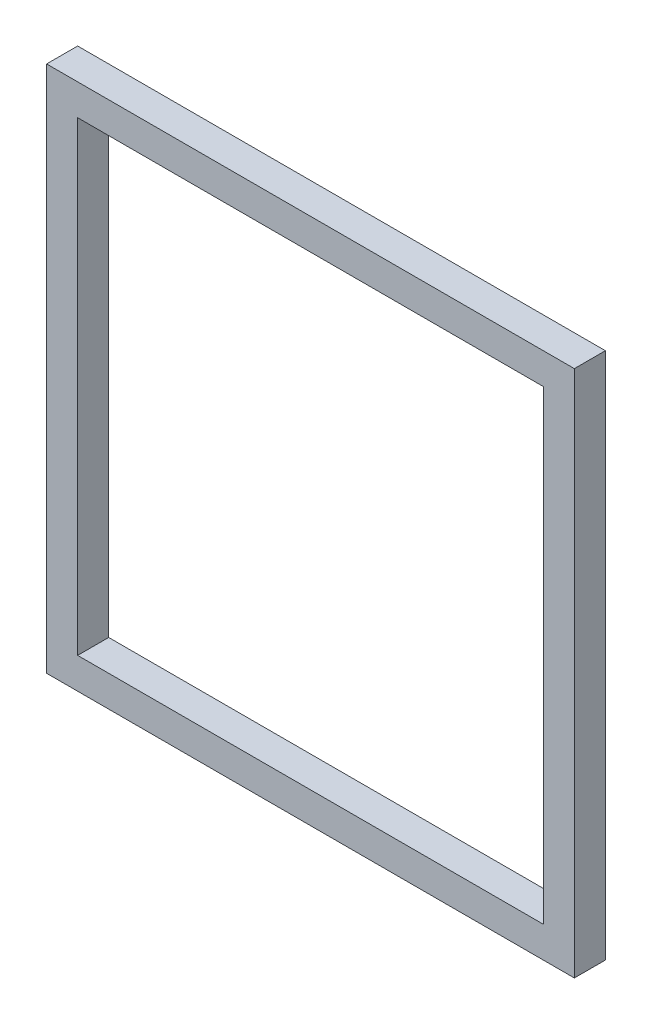
ISO-10303-21;
HEADER;
FILE_DESCRIPTION(('STEP AP214'),'2;1');
FILE_NAME('part.step','',(''),(''),'','','');
FILE_SCHEMA(('AUTOMOTIVE_DESIGN { 1 0 10303 214 1 1 1 1 }'));
ENDSEC;
DATA;
#1=APPLICATION_CONTEXT('core data for automotive mechanical design processes');
#2=APPLICATION_PROTOCOL_DEFINITION('international standard','automotive_design',2000,#1);
#3=PRODUCT_CONTEXT('',#1,'mechanical');
#4=PRODUCT('Part','Part','',(#3));
#5=PRODUCT_RELATED_PRODUCT_CATEGORY('part','',(#4));
#6=PRODUCT_DEFINITION_FORMATION('','',#4);
#7=PRODUCT_DEFINITION_CONTEXT('part definition',#1,'design');
#8=PRODUCT_DEFINITION('design','',#6,#7);
#9=PRODUCT_DEFINITION_SHAPE('','',#8);
#10=(LENGTH_UNIT() NAMED_UNIT(*) SI_UNIT(.MILLI.,.METRE.));
#11=(NAMED_UNIT(*) PLANE_ANGLE_UNIT() SI_UNIT($,.RADIAN.));
#12=(NAMED_UNIT(*) SI_UNIT($,.STERADIAN.) SOLID_ANGLE_UNIT());
#13=UNCERTAINTY_MEASURE_WITH_UNIT(LENGTH_MEASURE(1.E-05),#10,'distance_accuracy_value','');
#14=(GEOMETRIC_REPRESENTATION_CONTEXT(3) GLOBAL_UNCERTAINTY_ASSIGNED_CONTEXT((#13)) GLOBAL_UNIT_ASSIGNED_CONTEXT((#10,
#11,#12)) REPRESENTATION_CONTEXT('',''));
#15=CARTESIAN_POINT('',(0.,0.,0.));
#16=DIRECTION('',(0.,0.,1.));
#17=DIRECTION('',(1.,0.,0.));
#18=AXIS2_PLACEMENT_3D('',#15,#16,#17);
#19=CARTESIAN_POINT('',(0.,0.,20.));
#20=DIRECTION('',(0.,0.,1.));
#21=DIRECTION('',(1.,0.,0.));
#22=AXIS2_PLACEMENT_3D('',#19,#20,#21);
#23=PLANE('',#22);
#24=DIRECTION('',(0.,-1.,0.));
#25=VECTOR('',#24,1.);
#26=CARTESIAN_POINT('',(0.,0.,20.));
#27=LINE('',#26,#25);
#28=CARTESIAN_POINT('',(0.,0.,20.));
#29=VERTEX_POINT('',#28);
#30=CARTESIAN_POINT('',(0.,-340.,20.));
#31=VERTEX_POINT('',#30);
#32=EDGE_CURVE('E135',#29,#31,#27,.T.);
#33=ORIENTED_EDGE('',*,*,#32,.T.);
#34=DIRECTION('',(1.,0.,0.));
#35=VECTOR('',#34,1.);
#36=CARTESIAN_POINT('',(0.,-340.,20.));
#37=LINE('',#36,#35);
#38=CARTESIAN_POINT('',(340.,-340.,20.));
#39=VERTEX_POINT('',#38);
#40=EDGE_CURVE('E138',#31,#39,#37,.T.);
#41=ORIENTED_EDGE('',*,*,#40,.T.);
#42=DIRECTION('',(0.,1.,0.));
#43=VECTOR('',#42,1.);
#44=CARTESIAN_POINT('',(340.,0.,20.));
#45=LINE('',#44,#43);
#46=CARTESIAN_POINT('',(340.,0.,20.));
#47=VERTEX_POINT('',#46);
#48=EDGE_CURVE('E141',#39,#47,#45,.T.);
#49=ORIENTED_EDGE('',*,*,#48,.T.);
#50=DIRECTION('',(-1.,0.,0.));
#51=VECTOR('',#50,1.);
#52=CARTESIAN_POINT('',(0.,0.,20.));
#53=LINE('',#52,#51);
#54=EDGE_CURVE('E143',#47,#29,#53,.T.);
#55=ORIENTED_EDGE('',*,*,#54,.T.);
#56=EDGE_LOOP('',(#33,#41,#49,#55));
#57=FACE_BOUND('',#56,.T.);
#58=DIRECTION('',(0.,-1.,0.));
#59=VECTOR('',#58,1.);
#60=CARTESIAN_POINT('',(20.,-20.,20.));
#61=LINE('',#60,#59);
#62=CARTESIAN_POINT('',(20.,-20.,20.));
#63=VERTEX_POINT('',#62);
#64=CARTESIAN_POINT('',(20.,-320.,20.));
#65=VERTEX_POINT('',#64);
#66=EDGE_CURVE('E107',#63,#65,#61,.T.);
#67=ORIENTED_EDGE('',*,*,#66,.F.);
#68=DIRECTION('',(-1.,0.,0.));
#69=VECTOR('',#68,1.);
#70=CARTESIAN_POINT('',(320.,-20.,20.));
#71=LINE('',#70,#69);
#72=CARTESIAN_POINT('',(320.,-20.,20.));
#73=VERTEX_POINT('',#72);
#74=EDGE_CURVE('E99',#73,#63,#71,.T.);
#75=ORIENTED_EDGE('',*,*,#74,.F.);
#76=DIRECTION('',(0.,1.,0.));
#77=VECTOR('',#76,1.);
#78=CARTESIAN_POINT('',(320.,-320.,20.));
#79=LINE('',#78,#77);
#80=CARTESIAN_POINT('',(320.,-320.,20.));
#81=VERTEX_POINT('',#80);
#82=EDGE_CURVE('E121',#81,#73,#79,.T.);
#83=ORIENTED_EDGE('',*,*,#82,.F.);
#84=DIRECTION('',(1.,0.,0.));
#85=VECTOR('',#84,1.);
#86=CARTESIAN_POINT('',(20.,-320.,20.));
#87=LINE('',#86,#85);
#88=EDGE_CURVE('E119',#65,#81,#87,.T.);
#89=ORIENTED_EDGE('',*,*,#88,.F.);
#90=EDGE_LOOP('',(#67,#75,#83,#89));
#91=FACE_BOUND('',#90,.T.);
#92=ADVANCED_FACE('F34',(#57,#91),#23,.T.);
#93=CARTESIAN_POINT('',(0.,0.,0.));
#94=DIRECTION('',(0.,0.,1.));
#95=DIRECTION('',(1.,0.,0.));
#96=AXIS2_PLACEMENT_3D('',#93,#94,#95);
#97=PLANE('',#96);
#98=DIRECTION('',(0.,-1.,0.));
#99=VECTOR('',#98,1.);
#100=CARTESIAN_POINT('',(0.,0.,0.));
#101=LINE('',#100,#99);
#102=CARTESIAN_POINT('',(0.,0.,0.));
#103=VERTEX_POINT('',#102);
#104=CARTESIAN_POINT('',(0.,-340.,0.));
#105=VERTEX_POINT('',#104);
#106=EDGE_CURVE('E115',#103,#105,#101,.T.);
#107=ORIENTED_EDGE('',*,*,#106,.F.);
#108=DIRECTION('',(-1.,0.,0.));
#109=VECTOR('',#108,1.);
#110=CARTESIAN_POINT('',(0.,0.,0.));
#111=LINE('',#110,#109);
#112=CARTESIAN_POINT('',(340.,0.,0.));
#113=VERTEX_POINT('',#112);
#114=EDGE_CURVE('E139',#113,#103,#111,.T.);
#115=ORIENTED_EDGE('',*,*,#114,.F.);
#116=DIRECTION('',(0.,1.,0.));
#117=VECTOR('',#116,1.);
#118=CARTESIAN_POINT('',(340.,0.,0.));
#119=LINE('',#118,#117);
#120=CARTESIAN_POINT('',(340.,-340.,0.));
#121=VERTEX_POINT('',#120);
#122=EDGE_CURVE('E150',#121,#113,#119,.T.);
#123=ORIENTED_EDGE('',*,*,#122,.F.);
#124=DIRECTION('',(1.,0.,0.));
#125=VECTOR('',#124,1.);
#126=CARTESIAN_POINT('',(0.,-340.,0.));
#127=LINE('',#126,#125);
#128=EDGE_CURVE('E148',#105,#121,#127,.T.);
#129=ORIENTED_EDGE('',*,*,#128,.F.);
#130=EDGE_LOOP('',(#107,#115,#123,#129));
#131=FACE_BOUND('',#130,.T.);
#132=DIRECTION('',(-1.,0.,0.));
#133=VECTOR('',#132,1.);
#134=CARTESIAN_POINT('',(320.,-20.,0.));
#135=LINE('',#134,#133);
#136=CARTESIAN_POINT('',(320.,-20.,0.));
#137=VERTEX_POINT('',#136);
#138=CARTESIAN_POINT('',(20.,-20.,0.));
#139=VERTEX_POINT('',#138);
#140=EDGE_CURVE('E57',#137,#139,#135,.T.);
#141=ORIENTED_EDGE('',*,*,#140,.T.);
#142=DIRECTION('',(0.,-1.,0.));
#143=VECTOR('',#142,1.);
#144=CARTESIAN_POINT('',(20.,-20.,0.));
#145=LINE('',#144,#143);
#146=CARTESIAN_POINT('',(20.,-320.,0.));
#147=VERTEX_POINT('',#146);
#148=EDGE_CURVE('E114',#139,#147,#145,.T.);
#149=ORIENTED_EDGE('',*,*,#148,.T.);
#150=DIRECTION('',(1.,0.,0.));
#151=VECTOR('',#150,1.);
#152=CARTESIAN_POINT('',(20.,-320.,0.));
#153=LINE('',#152,#151);
#154=CARTESIAN_POINT('',(320.,-320.,0.));
#155=VERTEX_POINT('',#154);
#156=EDGE_CURVE('E127',#147,#155,#153,.T.);
#157=ORIENTED_EDGE('',*,*,#156,.T.);
#158=DIRECTION('',(0.,1.,0.));
#159=VECTOR('',#158,1.);
#160=CARTESIAN_POINT('',(320.,-320.,0.));
#161=LINE('',#160,#159);
#162=EDGE_CURVE('E108',#155,#137,#161,.T.);
#163=ORIENTED_EDGE('',*,*,#162,.T.);
#164=EDGE_LOOP('',(#141,#149,#157,#163));
#165=FACE_BOUND('',#164,.T.);
#166=ADVANCED_FACE('F168',(#131,#165),#97,.F.);
#167=CARTESIAN_POINT('',(0.,0.,20.));
#168=DIRECTION('',(1.,0.,0.));
#169=DIRECTION('',(0.,1.,0.));
#170=AXIS2_PLACEMENT_3D('',#167,#168,#169);
#171=PLANE('',#170);
#172=ORIENTED_EDGE('',*,*,#106,.T.);
#173=DIRECTION('',(0.,0.,-1.));
#174=VECTOR('',#173,1.);
#175=CARTESIAN_POINT('',(0.,-340.,20.));
#176=LINE('',#175,#174);
#177=EDGE_CURVE('E11',#31,#105,#176,.T.);
#178=ORIENTED_EDGE('',*,*,#177,.F.);
#179=ORIENTED_EDGE('',*,*,#32,.F.);
#180=DIRECTION('',(0.,0.,-1.));
#181=VECTOR('',#180,1.);
#182=CARTESIAN_POINT('',(0.,0.,20.));
#183=LINE('',#182,#181);
#184=EDGE_CURVE('E145',#29,#103,#183,.T.);
#185=ORIENTED_EDGE('',*,*,#184,.T.);
#186=EDGE_LOOP('',(#172,#178,#179,#185));
#187=FACE_BOUND('',#186,.T.);
#188=ADVANCED_FACE('F36',(#187),#171,.F.);
#189=CARTESIAN_POINT('',(0.,-340.,20.));
#190=DIRECTION('',(0.,1.,0.));
#191=DIRECTION('',(0.,0.,1.));
#192=AXIS2_PLACEMENT_3D('',#189,#190,#191);
#193=PLANE('',#192);
#194=ORIENTED_EDGE('',*,*,#128,.T.);
#195=DIRECTION('',(0.,0.,-1.));
#196=VECTOR('',#195,1.);
#197=CARTESIAN_POINT('',(340.,-340.,20.));
#198=LINE('',#197,#196);
#199=EDGE_CURVE('E42',#39,#121,#198,.T.);
#200=ORIENTED_EDGE('',*,*,#199,.F.);
#201=ORIENTED_EDGE('',*,*,#40,.F.);
#202=ORIENTED_EDGE('',*,*,#177,.T.);
#203=EDGE_LOOP('',(#194,#200,#201,#202));
#204=FACE_BOUND('',#203,.T.);
#205=ADVANCED_FACE('F178',(#204),#193,.F.);
#206=CARTESIAN_POINT('',(340.,0.,20.));
#207=DIRECTION('',(-1.,0.,0.));
#208=DIRECTION('',(0.,0.,1.));
#209=AXIS2_PLACEMENT_3D('',#206,#207,#208);
#210=PLANE('',#209);
#211=ORIENTED_EDGE('',*,*,#122,.T.);
#212=DIRECTION('',(0.,0.,-1.));
#213=VECTOR('',#212,1.);
#214=CARTESIAN_POINT('',(340.,0.,20.));
#215=LINE('',#214,#213);
#216=EDGE_CURVE('E155',#47,#113,#215,.T.);
#217=ORIENTED_EDGE('',*,*,#216,.F.);
#218=ORIENTED_EDGE('',*,*,#48,.F.);
#219=ORIENTED_EDGE('',*,*,#199,.T.);
#220=EDGE_LOOP('',(#211,#217,#218,#219));
#221=FACE_BOUND('',#220,.T.);
#222=ADVANCED_FACE('F162',(#221),#210,.F.);
#223=CARTESIAN_POINT('',(0.,0.,20.));
#224=DIRECTION('',(0.,-1.,0.));
#225=DIRECTION('',(0.,0.,-1.));
#226=AXIS2_PLACEMENT_3D('',#223,#224,#225);
#227=PLANE('',#226);
#228=ORIENTED_EDGE('',*,*,#114,.T.);
#229=ORIENTED_EDGE('',*,*,#184,.F.);
#230=ORIENTED_EDGE('',*,*,#54,.F.);
#231=ORIENTED_EDGE('',*,*,#216,.T.);
#232=EDGE_LOOP('',(#228,#229,#230,#231));
#233=FACE_BOUND('',#232,.T.);
#234=ADVANCED_FACE('F172',(#233),#227,.F.);
#235=CARTESIAN_POINT('',(320.,-20.,20.));
#236=DIRECTION('',(0.,-1.,0.));
#237=DIRECTION('',(1.,0.,0.));
#238=AXIS2_PLACEMENT_3D('',#235,#236,#237);
#239=PLANE('',#238);
#240=ORIENTED_EDGE('',*,*,#140,.F.);
#241=DIRECTION('',(0.,0.,-1.));
#242=VECTOR('',#241,1.);
#243=CARTESIAN_POINT('',(320.,-20.,20.));
#244=LINE('',#243,#242);
#245=EDGE_CURVE('E103',#73,#137,#244,.T.);
#246=ORIENTED_EDGE('',*,*,#245,.F.);
#247=ORIENTED_EDGE('',*,*,#74,.T.);
#248=DIRECTION('',(0.,0.,-1.));
#249=VECTOR('',#248,1.);
#250=CARTESIAN_POINT('',(20.,-20.,20.));
#251=LINE('',#250,#249);
#252=EDGE_CURVE('E102',#63,#139,#251,.T.);
#253=ORIENTED_EDGE('',*,*,#252,.T.);
#254=EDGE_LOOP('',(#240,#246,#247,#253));
#255=FACE_BOUND('',#254,.T.);
#256=ADVANCED_FACE('F101',(#255),#239,.T.);
#257=CARTESIAN_POINT('',(20.,-20.,20.));
#258=DIRECTION('',(1.,0.,0.));
#259=DIRECTION('',(0.,1.,0.));
#260=AXIS2_PLACEMENT_3D('',#257,#258,#259);
#261=PLANE('',#260);
#262=ORIENTED_EDGE('',*,*,#148,.F.);
#263=ORIENTED_EDGE('',*,*,#252,.F.);
#264=ORIENTED_EDGE('',*,*,#66,.T.);
#265=DIRECTION('',(0.,0.,-1.));
#266=VECTOR('',#265,1.);
#267=CARTESIAN_POINT('',(20.,-320.,20.));
#268=LINE('',#267,#266);
#269=EDGE_CURVE('E116',#65,#147,#268,.T.);
#270=ORIENTED_EDGE('',*,*,#269,.T.);
#271=EDGE_LOOP('',(#262,#263,#264,#270));
#272=FACE_BOUND('',#271,.T.);
#273=ADVANCED_FACE('F111',(#272),#261,.T.);
#274=CARTESIAN_POINT('',(20.,-320.,20.));
#275=DIRECTION('',(0.,1.,0.));
#276=DIRECTION('',(0.,0.,1.));
#277=AXIS2_PLACEMENT_3D('',#274,#275,#276);
#278=PLANE('',#277);
#279=ORIENTED_EDGE('',*,*,#156,.F.);
#280=ORIENTED_EDGE('',*,*,#269,.F.);
#281=ORIENTED_EDGE('',*,*,#88,.T.);
#282=DIRECTION('',(0.,0.,-1.));
#283=VECTOR('',#282,1.);
#284=CARTESIAN_POINT('',(320.,-320.,20.));
#285=LINE('',#284,#283);
#286=EDGE_CURVE('E49',#81,#155,#285,.T.);
#287=ORIENTED_EDGE('',*,*,#286,.T.);
#288=EDGE_LOOP('',(#279,#280,#281,#287));
#289=FACE_BOUND('',#288,.T.);
#290=ADVANCED_FACE('F201',(#289),#278,.T.);
#291=CARTESIAN_POINT('',(320.,-320.,20.));
#292=DIRECTION('',(-1.,0.,0.));
#293=DIRECTION('',(0.,0.,1.));
#294=AXIS2_PLACEMENT_3D('',#291,#292,#293);
#295=PLANE('',#294);
#296=ORIENTED_EDGE('',*,*,#162,.F.);
#297=ORIENTED_EDGE('',*,*,#286,.F.);
#298=ORIENTED_EDGE('',*,*,#82,.T.);
#299=ORIENTED_EDGE('',*,*,#245,.T.);
#300=EDGE_LOOP('',(#296,#297,#298,#299));
#301=FACE_BOUND('',#300,.T.);
#302=ADVANCED_FACE('F205',(#301),#295,.T.);
#303=CLOSED_SHELL('',(#92,#166,#188,#205,#222,#234,#256,#273,#290,#302));
#304=MANIFOLD_SOLID_BREP('B2',#303);
#305=ADVANCED_BREP_SHAPE_REPRESENTATION('',(#18,#304),#14);
#306=SHAPE_DEFINITION_REPRESENTATION(#9,#305);
ENDSEC;
END-ISO-10303-21;
